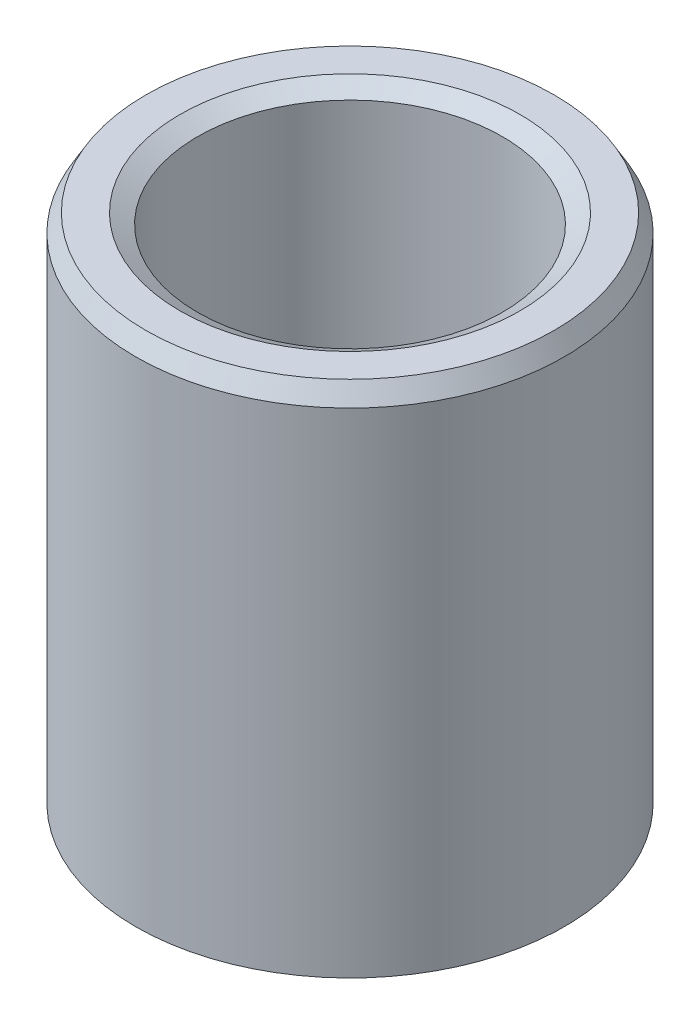
ISO-10303-21;
HEADER;
FILE_DESCRIPTION(('STEP AP214'),'2;1');
FILE_NAME('part.step','',(''),(''),'','','');
FILE_SCHEMA(('AUTOMOTIVE_DESIGN { 1 0 10303 214 1 1 1 1 }'));
ENDSEC;
DATA;
#1=APPLICATION_CONTEXT('core data for automotive mechanical design processes');
#2=APPLICATION_PROTOCOL_DEFINITION('international standard','automotive_design',2000,#1);
#3=PRODUCT_CONTEXT('',#1,'mechanical');
#4=PRODUCT('Part','Part','',(#3));
#5=PRODUCT_RELATED_PRODUCT_CATEGORY('part','',(#4));
#6=PRODUCT_DEFINITION_FORMATION('','',#4);
#7=PRODUCT_DEFINITION_CONTEXT('part definition',#1,'design');
#8=PRODUCT_DEFINITION('design','',#6,#7);
#9=PRODUCT_DEFINITION_SHAPE('','',#8);
#10=(LENGTH_UNIT() NAMED_UNIT(*) SI_UNIT(.MILLI.,.METRE.));
#11=(NAMED_UNIT(*) PLANE_ANGLE_UNIT() SI_UNIT($,.RADIAN.));
#12=(NAMED_UNIT(*) SI_UNIT($,.STERADIAN.) SOLID_ANGLE_UNIT());
#13=UNCERTAINTY_MEASURE_WITH_UNIT(LENGTH_MEASURE(1.E-05),#10,'distance_accuracy_value','');
#14=(GEOMETRIC_REPRESENTATION_CONTEXT(3) GLOBAL_UNCERTAINTY_ASSIGNED_CONTEXT((#13)) GLOBAL_UNIT_ASSIGNED_CONTEXT((#10,
#11,#12)) REPRESENTATION_CONTEXT('',''));
#15=CARTESIAN_POINT('',(0.,0.,0.));
#16=DIRECTION('',(0.,0.,1.));
#17=DIRECTION('',(1.,0.,0.));
#18=AXIS2_PLACEMENT_3D('',#15,#16,#17);
#19=CARTESIAN_POINT('',(0.,103.410292719145,0.));
#20=DIRECTION('',(0.,-1.,0.));
#21=DIRECTION('',(0.,0.,-1.));
#22=AXIS2_PLACEMENT_3D('',#19,#20,#21);
#23=CYLINDRICAL_SURFACE('',#22,42.5);
#24=CARTESIAN_POINT('',(0.,2.02903829448403,0.));
#25=DIRECTION('',(0.,1.,0.));
#26=DIRECTION('',(0.,0.,1.));
#27=AXIS2_PLACEMENT_3D('',#24,#25,#26);
#28=CIRCLE('',#27,42.5);
#29=CARTESIAN_POINT('',(0.,2.02903829448403,42.5));
#30=VERTEX_POINT('',#29);
#31=EDGE_CURVE('E10',#30,#30,#28,.T.);
#32=ORIENTED_EDGE('',*,*,#31,.T.);
#33=EDGE_LOOP('',(#32));
#34=FACE_BOUND('',#33,.T.);
#35=CARTESIAN_POINT('',(0.,99.895895302596,0.));
#36=DIRECTION('',(0.,1.,0.));
#37=DIRECTION('',(0.,0.,1.));
#38=AXIS2_PLACEMENT_3D('',#35,#36,#37);
#39=CIRCLE('',#38,42.5);
#40=CARTESIAN_POINT('',(0.,99.895895302596,42.5));
#41=VERTEX_POINT('',#40);
#42=EDGE_CURVE('E50',#41,#41,#39,.F.);
#43=ORIENTED_EDGE('',*,*,#42,.T.);
#44=EDGE_LOOP('',(#43));
#45=FACE_BOUND('',#44,.T.);
#46=ADVANCED_FACE('F39',(#34,#45),#23,.T.);
#47=CARTESIAN_POINT('',(0.,103.410292719145,0.));
#48=DIRECTION('',(0.,1.,0.));
#49=DIRECTION('',(0.,0.,1.));
#50=AXIS2_PLACEMENT_3D('',#47,#48,#49);
#51=PLANE('',#50);
#52=CARTESIAN_POINT('',(0.,103.410292719145,0.));
#53=DIRECTION('',(0.,1.,0.));
#54=DIRECTION('',(0.,0.,1.));
#55=AXIS2_PLACEMENT_3D('',#52,#53,#54);
#56=CIRCLE('',#55,33.7236418073441);
#57=CARTESIAN_POINT('',(0.,103.410292719145,33.723641807344));
#58=VERTEX_POINT('',#57);
#59=EDGE_CURVE('E58',#58,#58,#56,.F.);
#60=ORIENTED_EDGE('',*,*,#59,.T.);
#61=EDGE_LOOP('',(#60));
#62=FACE_BOUND('',#61,.T.);
#63=CARTESIAN_POINT('',(0.,103.410292719145,0.));
#64=DIRECTION('',(0.,1.,0.));
#65=DIRECTION('',(0.,0.,1.));
#66=AXIS2_PLACEMENT_3D('',#63,#64,#65);
#67=CIRCLE('',#66,40.470961705516);
#68=CARTESIAN_POINT('',(0.,103.410292719145,40.470961705516));
#69=VERTEX_POINT('',#68);
#70=EDGE_CURVE('E61',#69,#69,#67,.T.);
#71=ORIENTED_EDGE('',*,*,#70,.T.);
#72=EDGE_LOOP('',(#71));
#73=FACE_BOUND('',#72,.T.);
#74=ADVANCED_FACE('F88',(#62,#73),#51,.T.);
#75=CARTESIAN_POINT('',(0.,0.,0.));
#76=DIRECTION('',(0.,1.,0.));
#77=DIRECTION('',(0.,0.,1.));
#78=AXIS2_PLACEMENT_3D('',#75,#76,#77);
#79=PLANE('',#78);
#80=CARTESIAN_POINT('',(0.,0.,0.));
#81=DIRECTION('',(0.,1.,0.));
#82=DIRECTION('',(0.,0.,1.));
#83=AXIS2_PLACEMENT_3D('',#80,#81,#82);
#84=CIRCLE('',#83,32.2382826852789);
#85=CARTESIAN_POINT('',(0.,0.,32.2382826852789));
#86=VERTEX_POINT('',#85);
#87=EDGE_CURVE('E51',#86,#86,#84,.T.);
#88=ORIENTED_EDGE('',*,*,#87,.T.);
#89=EDGE_LOOP('',(#88));
#90=FACE_BOUND('',#89,.T.);
#91=CARTESIAN_POINT('',(0.,0.,0.));
#92=DIRECTION('',(0.,1.,0.));
#93=DIRECTION('',(0.,0.,1.));
#94=AXIS2_PLACEMENT_3D('',#91,#92,#93);
#95=CIRCLE('',#94,38.9856025834508);
#96=CARTESIAN_POINT('',(0.,0.,38.9856025834508));
#97=VERTEX_POINT('',#96);
#98=EDGE_CURVE('E54',#97,#97,#95,.F.);
#99=ORIENTED_EDGE('',*,*,#98,.T.);
#100=EDGE_LOOP('',(#99));
#101=FACE_BOUND('',#100,.T.);
#102=ADVANCED_FACE('F83',(#90,#101),#79,.F.);
#103=CARTESIAN_POINT('',(0.,103.410292719145,0.));
#104=DIRECTION('',(0.,-1.,0.));
#105=DIRECTION('',(0.,0.,-1.));
#106=AXIS2_PLACEMENT_3D('',#103,#104,#105);
#107=CYLINDRICAL_SURFACE('',#106,30.2092443907948);
#108=CARTESIAN_POINT('',(0.,101.381254424661,0.));
#109=DIRECTION('',(0.,1.,0.));
#110=DIRECTION('',(0.,0.,1.));
#111=AXIS2_PLACEMENT_3D('',#108,#109,#110);
#112=CIRCLE('',#111,30.2092443907948);
#113=CARTESIAN_POINT('',(0.,101.381254424661,30.2092443907948));
#114=VERTEX_POINT('',#113);
#115=EDGE_CURVE('E67',#114,#114,#112,.T.);
#116=ORIENTED_EDGE('',*,*,#115,.T.);
#117=EDGE_LOOP('',(#116));
#118=FACE_BOUND('',#117,.T.);
#119=CARTESIAN_POINT('',(0.,3.51439741654926,0.));
#120=DIRECTION('',(0.,1.,0.));
#121=DIRECTION('',(0.,0.,1.));
#122=AXIS2_PLACEMENT_3D('',#119,#120,#121);
#123=CIRCLE('',#122,30.2092443907948);
#124=CARTESIAN_POINT('',(0.,3.51439741654926,30.2092443907948));
#125=VERTEX_POINT('',#124);
#126=EDGE_CURVE('E69',#125,#125,#123,.F.);
#127=ORIENTED_EDGE('',*,*,#126,.T.);
#128=EDGE_LOOP('',(#127));
#129=FACE_BOUND('',#128,.T.);
#130=ADVANCED_FACE('F71',(#118,#129),#107,.F.);
#131=CARTESIAN_POINT('',(0.,101.381254424661,0.));
#132=DIRECTION('',(0.,1.,0.));
#133=DIRECTION('',(0.,0.,1.));
#134=AXIS2_PLACEMENT_3D('',#131,#132,#133);
#135=CONICAL_SURFACE('',#134,30.2092443907948,1.0471975511966);
#136=CARTESIAN_POINT('',(0.,103.410292719145,33.723641807344));
#137=CARTESIAN_POINT('',(0.,103.389156903578,33.6870335009217));
#138=CARTESIAN_POINT('',(0.,103.36802108801,33.6504251944993));
#139=CARTESIAN_POINT('',(0.,103.325749456875,33.5772085816545));
#140=CARTESIAN_POINT('',(0.,103.304613641308,33.5406002752321));
#141=CARTESIAN_POINT('',(0.,103.262342010173,33.4673836623873));
#142=CARTESIAN_POINT('',(0.,103.241206194605,33.4307753559649));
#143=CARTESIAN_POINT('',(0.,103.19893456347,33.3575587431202));
#144=CARTESIAN_POINT('',(0.,103.177798747902,33.3209504366978));
#145=CARTESIAN_POINT('',(0.,103.135527116767,33.247733823853));
#146=CARTESIAN_POINT('',(0.,103.1143913012,33.2111255174306));
#147=CARTESIAN_POINT('',(0.,103.072119670065,33.1379089045858));
#148=CARTESIAN_POINT('',(0.,103.050983854497,33.1013005981634));
#149=CARTESIAN_POINT('',(0.,103.008712223362,33.0280839853187));
#150=CARTESIAN_POINT('',(0.,102.987576407795,32.9914756788963));
#151=CARTESIAN_POINT('',(0.,102.945304776659,32.9182590660515));
#152=CARTESIAN_POINT('',(0.,102.924168961092,32.8816507596291));
#153=CARTESIAN_POINT('',(0.,102.881897329957,32.8084341467844));
#154=CARTESIAN_POINT('',(0.,102.860761514389,32.771825840362));
#155=CARTESIAN_POINT('',(0.,102.818489883254,32.6986092275172));
#156=CARTESIAN_POINT('',(0.,102.797354067687,32.6620009210948));
#157=CARTESIAN_POINT('',(0.,102.755082436552,32.58878430825));
#158=CARTESIAN_POINT('',(0.,102.733946620984,32.5521760018276));
#159=CARTESIAN_POINT('',(0.,102.691674989849,32.4789593889829));
#160=CARTESIAN_POINT('',(0.,102.670539174281,32.4423510825605));
#161=CARTESIAN_POINT('',(0.,102.628267543146,32.3691344697157));
#162=CARTESIAN_POINT('',(0.,102.607131727579,32.3325261632933));
#163=CARTESIAN_POINT('',(0.,102.564860096444,32.2593095504485));
#164=CARTESIAN_POINT('',(0.,102.543724280876,32.2227012440262));
#165=CARTESIAN_POINT('',(0.,102.501452649741,32.1494846311814));
#166=CARTESIAN_POINT('',(0.,102.480316834173,32.112876324759));
#167=CARTESIAN_POINT('',(0.,102.438045203038,32.0396597119142));
#168=CARTESIAN_POINT('',(0.,102.416909387471,32.0030514054918));
#169=CARTESIAN_POINT('',(0.,102.374637756336,31.929834792647));
#170=CARTESIAN_POINT('',(0.,102.353501940768,31.8932264862247));
#171=CARTESIAN_POINT('',(0.,102.311230309633,31.8200098733799));
#172=CARTESIAN_POINT('',(0.,102.290094494066,31.7834015669575));
#173=CARTESIAN_POINT('',(0.,102.247822862931,31.7101849541127));
#174=CARTESIAN_POINT('',(0.,102.226687047363,31.6735766476903));
#175=CARTESIAN_POINT('',(0.,102.184415416228,31.6003600348456));
#176=CARTESIAN_POINT('',(0.,102.16327960066,31.5637517284232));
#177=CARTESIAN_POINT('',(0.,102.121007969525,31.4905351155784));
#178=CARTESIAN_POINT('',(0.,102.099872153958,31.453926809156));
#179=CARTESIAN_POINT('',(0.,102.057600522823,31.3807101963112));
#180=CARTESIAN_POINT('',(0.,102.036464707255,31.3441018898889));
#181=CARTESIAN_POINT('',(0.,101.99419307612,31.2708852770441));
#182=CARTESIAN_POINT('',(0.,101.973057260552,31.2342769706217));
#183=CARTESIAN_POINT('',(0.,101.930785629417,31.1610603577769));
#184=CARTESIAN_POINT('',(0.,101.90964981385,31.1244520513545));
#185=CARTESIAN_POINT('',(0.,101.867378182715,31.0512354385097));
#186=CARTESIAN_POINT('',(0.,101.846242367147,31.0146271320874));
#187=CARTESIAN_POINT('',(0.,101.803970736012,30.9414105192426));
#188=CARTESIAN_POINT('',(0.,101.782834920445,30.9048022128202));
#189=CARTESIAN_POINT('',(0.,101.74056328931,30.8315855999754));
#190=CARTESIAN_POINT('',(0.,101.719427473742,30.794977293553));
#191=CARTESIAN_POINT('',(0.,101.677155842607,30.7217606807083));
#192=CARTESIAN_POINT('',(0.,101.656020027039,30.6851523742859));
#193=CARTESIAN_POINT('',(0.,101.613748395904,30.6119357614411));
#194=CARTESIAN_POINT('',(0.,101.592612580337,30.5753274550187));
#195=CARTESIAN_POINT('',(0.,101.550340949202,30.5021108421739));
#196=CARTESIAN_POINT('',(0.,101.529205133634,30.4655025357515));
#197=CARTESIAN_POINT('',(0.,101.486933502499,30.3922859229068));
#198=CARTESIAN_POINT('',(0.,101.465797686931,30.3556776164844));
#199=CARTESIAN_POINT('',(0.,101.423526055796,30.2824610036396));
#200=CARTESIAN_POINT('',(0.,101.402390240229,30.2458526972172));
#201=CARTESIAN_POINT('',(0.,101.381254424661,30.2092443907948));
#202=B_SPLINE_CURVE_WITH_KNOTS('',3,(#136,#137,#138,#139,#140,#141,#142,#143,#144,#145,#146,
#147,#148,#149,#150,#151,#152,#153,#154,#155,#156,#157,#158,#159,#160,#161,#162,#163,#164,#165,
#166,#167,#168,#169,#170,#171,#172,#173,#174,#175,#176,#177,#178,#179,#180,#181,#182,#183,#184,
#185,#186,#187,#188,#189,#190,#191,#192,#193,#194,#195,#196,#197,#198,#199,#200,#201),
.UNSPECIFIED.,.F.,.F.,(4,2,2,2,2,2,2,2,2,2,2,2,2,2,2,2,2,2,2,2,2,2,2,2,2,2,2,2,2,2,2,2,4),(0.,
0.12681489340525,0.2536297868105,0.380444680215749,0.507259573621005,0.634074467026254,
0.760889360431504,0.887704253836753,1.014519147242,1.14133404064725,1.2681489340525,
1.39496382745776,1.52177872086301,1.64859361426826,1.7754085076735,1.90222340107876,
2.02903829448401,2.15585318788925,2.28266808129451,2.40948297469976,2.536297868105,
2.66311276151025,2.78992765491551,2.91674254832076,3.04355744172601,3.17037233513126,
3.29718722853651,3.42400212194176,3.55081701534701,3.67763190875226,3.80444680215751,
3.93126169556276,4.05807658896801),.UNSPECIFIED.);
#203=EDGE_CURVE('BSEAM77',#58,#114,#202,.T.);
#204=ORIENTED_EDGE('',*,*,#59,.F.);
#205=ORIENTED_EDGE('',*,*,#115,.F.);
#206=ORIENTED_EDGE('',*,*,#203,.T.);
#207=ORIENTED_EDGE('',*,*,#203,.F.);
#208=EDGE_LOOP('',(#204,#206,#205,#207));
#209=FACE_BOUND('',#208,.T.);
#210=ADVANCED_FACE('F77',(#209),#135,.F.);
#211=CARTESIAN_POINT('',(0.,0.,0.));
#212=DIRECTION('',(0.,-1.,0.));
#213=DIRECTION('',(0.,0.,-1.));
#214=AXIS2_PLACEMENT_3D('',#211,#212,#213);
#215=CONICAL_SURFACE('',#214,32.2382826852789,0.523598775598293);
#216=ORIENTED_EDGE('',*,*,#126,.F.);
#217=EDGE_LOOP('',(#216));
#218=FACE_BOUND('',#217,.T.);
#219=ORIENTED_EDGE('',*,*,#87,.F.);
#220=EDGE_LOOP('',(#219));
#221=FACE_BOUND('',#220,.T.);
#222=ADVANCED_FACE('F73',(#218,#221),#215,.F.);
#223=CARTESIAN_POINT('',(0.,2.02903829448403,0.));
#224=DIRECTION('',(0.,1.,0.));
#225=DIRECTION('',(0.,0.,1.));
#226=AXIS2_PLACEMENT_3D('',#223,#224,#225);
#227=CONICAL_SURFACE('',#226,42.5,1.0471975511966);
#228=ORIENTED_EDGE('',*,*,#98,.F.);
#229=EDGE_LOOP('',(#228));
#230=FACE_BOUND('',#229,.T.);
#231=ORIENTED_EDGE('',*,*,#31,.F.);
#232=EDGE_LOOP('',(#231));
#233=FACE_BOUND('',#232,.T.);
#234=ADVANCED_FACE('F76',(#230,#233),#227,.T.);
#235=CARTESIAN_POINT('',(0.,103.410292719145,0.));
#236=DIRECTION('',(0.,-1.,0.));
#237=DIRECTION('',(0.,0.,-1.));
#238=AXIS2_PLACEMENT_3D('',#235,#236,#237);
#239=CONICAL_SURFACE('',#238,40.470961705516,0.523598775598291);
#240=ORIENTED_EDGE('',*,*,#42,.F.);
#241=EDGE_LOOP('',(#240));
#242=FACE_BOUND('',#241,.T.);
#243=ORIENTED_EDGE('',*,*,#70,.F.);
#244=EDGE_LOOP('',(#243));
#245=FACE_BOUND('',#244,.T.);
#246=ADVANCED_FACE('F45',(#242,#245),#239,.T.);
#247=CLOSED_SHELL('',(#46,#74,#102,#130,#210,#222,#234,#246));
#248=MANIFOLD_SOLID_BREP('B2',#247);
#249=ADVANCED_BREP_SHAPE_REPRESENTATION('',(#18,#248),#14);
#250=SHAPE_DEFINITION_REPRESENTATION(#9,#249);
ENDSEC;
END-ISO-10303-21;
